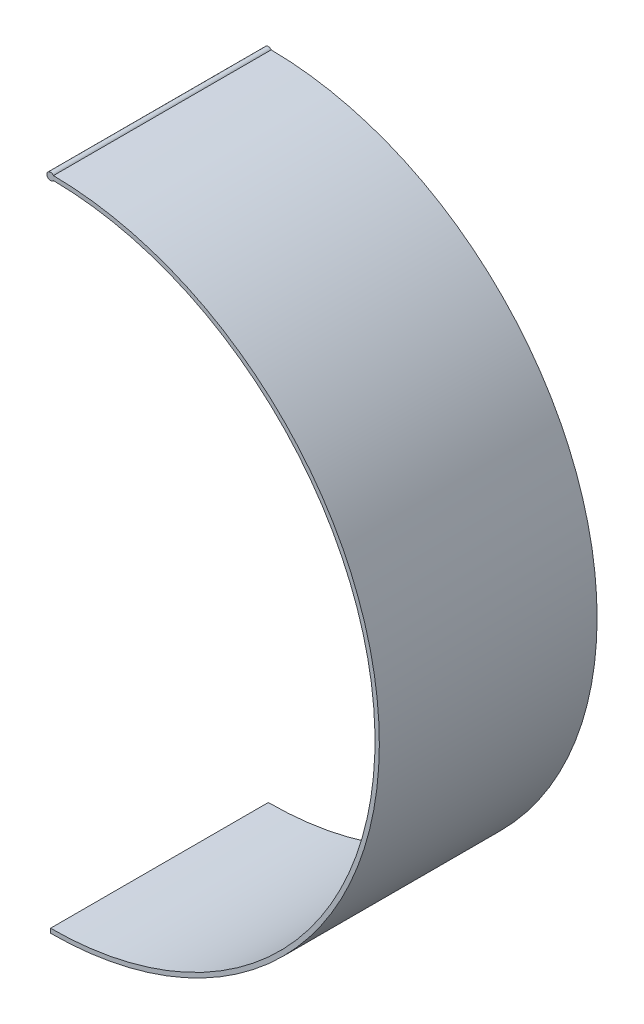
ISO-10303-21;
HEADER;
FILE_DESCRIPTION(('STEP AP214'),'2;1');
FILE_NAME('part.step','',(''),(''),'','','');
FILE_SCHEMA(('AUTOMOTIVE_DESIGN { 1 0 10303 214 1 1 1 1 }'));
ENDSEC;
DATA;
#1=APPLICATION_CONTEXT('core data for automotive mechanical design processes');
#2=APPLICATION_PROTOCOL_DEFINITION('international standard','automotive_design',2000,#1);
#3=PRODUCT_CONTEXT('',#1,'mechanical');
#4=PRODUCT('Part','Part','',(#3));
#5=PRODUCT_RELATED_PRODUCT_CATEGORY('part','',(#4));
#6=PRODUCT_DEFINITION_FORMATION('','',#4);
#7=PRODUCT_DEFINITION_CONTEXT('part definition',#1,'design');
#8=PRODUCT_DEFINITION('design','',#6,#7);
#9=PRODUCT_DEFINITION_SHAPE('','',#8);
#10=(LENGTH_UNIT() NAMED_UNIT(*) SI_UNIT(.MILLI.,.METRE.));
#11=(NAMED_UNIT(*) PLANE_ANGLE_UNIT() SI_UNIT($,.RADIAN.));
#12=(NAMED_UNIT(*) SI_UNIT($,.STERADIAN.) SOLID_ANGLE_UNIT());
#13=UNCERTAINTY_MEASURE_WITH_UNIT(LENGTH_MEASURE(1.E-05),#10,'distance_accuracy_value','');
#14=(GEOMETRIC_REPRESENTATION_CONTEXT(3) GLOBAL_UNCERTAINTY_ASSIGNED_CONTEXT((#13)) GLOBAL_UNIT_ASSIGNED_CONTEXT((#10,
#11,#12)) REPRESENTATION_CONTEXT('',''));
#15=CARTESIAN_POINT('',(0.,0.,0.));
#16=DIRECTION('',(0.,0.,1.));
#17=DIRECTION('',(1.,0.,0.));
#18=AXIS2_PLACEMENT_3D('',#15,#16,#17);
#19=CARTESIAN_POINT('',(0.,0.,15.));
#20=DIRECTION('',(0.,0.,-1.));
#21=DIRECTION('',(-1.,0.,0.));
#22=AXIS2_PLACEMENT_3D('',#19,#20,#21);
#23=CYLINDRICAL_SURFACE('',#22,0.25);
#24=CARTESIAN_POINT('',(0.,0.,15.));
#25=DIRECTION('',(0.,0.,1.));
#26=DIRECTION('',(1.,0.,0.));
#27=AXIS2_PLACEMENT_3D('',#24,#25,#26);
#28=CIRCLE('',#27,0.25);
#29=CARTESIAN_POINT('',(0.200663590477224,0.149111111111107,15.));
#30=VERTEX_POINT('',#29);
#31=CARTESIAN_POINT('',(0.199330236567053,-0.150888888888888,15.));
#32=VERTEX_POINT('',#31);
#33=EDGE_CURVE('E11',#30,#32,#28,.T.);
#34=ORIENTED_EDGE('',*,*,#33,.F.);
#35=DIRECTION('',(0.,0.,1.));
#36=VECTOR('',#35,1.);
#37=CARTESIAN_POINT('',(0.200663590477224,0.14911111111111,7.5));
#38=LINE('',#37,#36);
#39=CARTESIAN_POINT('',(0.200663590477224,0.14911111111111,0.));
#40=VERTEX_POINT('',#39);
#41=EDGE_CURVE('E106',#30,#40,#38,.F.);
#42=ORIENTED_EDGE('',*,*,#41,.T.);
#43=CARTESIAN_POINT('',(0.,0.,0.));
#44=DIRECTION('',(0.,0.,1.));
#45=DIRECTION('',(1.,0.,0.));
#46=AXIS2_PLACEMENT_3D('',#43,#44,#45);
#47=CIRCLE('',#46,0.25);
#48=CARTESIAN_POINT('',(0.199330236567053,-0.150888888888888,0.));
#49=VERTEX_POINT('',#48);
#50=EDGE_CURVE('E39',#40,#49,#47,.T.);
#51=ORIENTED_EDGE('',*,*,#50,.T.);
#52=DIRECTION('',(0.,0.,1.));
#53=VECTOR('',#52,1.);
#54=CARTESIAN_POINT('',(0.199330236567053,-0.150888888888888,7.5));
#55=LINE('',#54,#53);
#56=EDGE_CURVE('E83',#49,#32,#55,.T.);
#57=ORIENTED_EDGE('',*,*,#56,.T.);
#58=EDGE_LOOP('',(#34,#42,#51,#57));
#59=FACE_BOUND('',#58,.T.);
#60=ADVANCED_FACE('F36',(#59),#23,.T.);
#61=CARTESIAN_POINT('',(0.,0.,15.));
#62=DIRECTION('',(0.,0.,1.));
#63=DIRECTION('',(1.,0.,0.));
#64=AXIS2_PLACEMENT_3D('',#61,#62,#63);
#65=PLANE('',#64);
#66=ORIENTED_EDGE('',*,*,#33,.T.);
#67=CARTESIAN_POINT('',(0.,-22.5,15.));
#68=DIRECTION('',(0.,0.,-1.));
#69=DIRECTION('',(-1.,0.,0.));
#70=AXIS2_PLACEMENT_3D('',#67,#68,#69);
#71=CIRCLE('',#70,22.35);
#72=CARTESIAN_POINT('',(0.,-44.85,15.));
#73=VERTEX_POINT('',#72);
#74=EDGE_CURVE('E101',#32,#73,#71,.T.);
#75=ORIENTED_EDGE('',*,*,#74,.T.);
#76=DIRECTION('',(0.,-1.,0.));
#77=VECTOR('',#76,1.);
#78=CARTESIAN_POINT('',(0.,-44.85,15.));
#79=LINE('',#78,#77);
#80=CARTESIAN_POINT('',(0.,-45.15,15.));
#81=VERTEX_POINT('',#80);
#82=EDGE_CURVE('E93',#73,#81,#79,.T.);
#83=ORIENTED_EDGE('',*,*,#82,.T.);
#84=CARTESIAN_POINT('',(0.,-22.5,15.));
#85=DIRECTION('',(0.,0.,1.));
#86=DIRECTION('',(-1.,0.,0.));
#87=AXIS2_PLACEMENT_3D('',#84,#85,#86);
#88=CIRCLE('',#87,22.65);
#89=EDGE_CURVE('E49',#81,#30,#88,.T.);
#90=ORIENTED_EDGE('',*,*,#89,.T.);
#91=EDGE_LOOP('',(#66,#75,#83,#90));
#92=FACE_BOUND('',#91,.T.);
#93=ADVANCED_FACE('F109',(#92),#65,.T.);
#94=CARTESIAN_POINT('',(0.,0.,0.));
#95=DIRECTION('',(0.,0.,1.));
#96=DIRECTION('',(1.,0.,0.));
#97=AXIS2_PLACEMENT_3D('',#94,#95,#96);
#98=PLANE('',#97);
#99=ORIENTED_EDGE('',*,*,#50,.F.);
#100=CARTESIAN_POINT('',(0.,-22.5,0.));
#101=DIRECTION('',(0.,0.,1.));
#102=DIRECTION('',(-1.,0.,0.));
#103=AXIS2_PLACEMENT_3D('',#100,#101,#102);
#104=CIRCLE('',#103,22.65);
#105=CARTESIAN_POINT('',(0.,-45.15,0.));
#106=VERTEX_POINT('',#105);
#107=EDGE_CURVE('E56',#106,#40,#104,.T.);
#108=ORIENTED_EDGE('',*,*,#107,.F.);
#109=DIRECTION('',(0.,-1.,0.));
#110=VECTOR('',#109,1.);
#111=CARTESIAN_POINT('',(0.,-44.85,0.));
#112=LINE('',#111,#110);
#113=CARTESIAN_POINT('',(0.,-44.85,0.));
#114=VERTEX_POINT('',#113);
#115=EDGE_CURVE('E88',#114,#106,#112,.T.);
#116=ORIENTED_EDGE('',*,*,#115,.F.);
#117=CARTESIAN_POINT('',(0.,-22.5,0.));
#118=DIRECTION('',(0.,0.,-1.));
#119=DIRECTION('',(-1.,0.,0.));
#120=AXIS2_PLACEMENT_3D('',#117,#118,#119);
#121=CIRCLE('',#120,22.35);
#122=EDGE_CURVE('E77',#49,#114,#121,.T.);
#123=ORIENTED_EDGE('',*,*,#122,.F.);
#124=EDGE_LOOP('',(#99,#108,#116,#123));
#125=FACE_BOUND('',#124,.T.);
#126=ADVANCED_FACE('F96',(#125),#98,.F.);
#127=CARTESIAN_POINT('',(0.,-22.5,0.));
#128=DIRECTION('',(0.,0.,1.));
#129=DIRECTION('',(1.,0.,0.));
#130=AXIS2_PLACEMENT_3D('',#127,#128,#129);
#131=CYLINDRICAL_SURFACE('',#130,22.65);
#132=ORIENTED_EDGE('',*,*,#41,.F.);
#133=ORIENTED_EDGE('',*,*,#89,.F.);
#134=DIRECTION('',(0.,0.,1.));
#135=VECTOR('',#134,1.);
#136=CARTESIAN_POINT('',(0.,-45.15,0.));
#137=LINE('',#136,#135);
#138=EDGE_CURVE('E94',#106,#81,#137,.T.);
#139=ORIENTED_EDGE('',*,*,#138,.F.);
#140=ORIENTED_EDGE('',*,*,#107,.T.);
#141=EDGE_LOOP('',(#132,#133,#139,#140));
#142=FACE_BOUND('',#141,.T.);
#143=ADVANCED_FACE('F116',(#142),#131,.T.);
#144=CARTESIAN_POINT('',(0.,-22.5,0.));
#145=DIRECTION('',(0.,0.,1.));
#146=DIRECTION('',(1.,0.,0.));
#147=AXIS2_PLACEMENT_3D('',#144,#145,#146);
#148=CYLINDRICAL_SURFACE('',#147,22.35);
#149=ORIENTED_EDGE('',*,*,#56,.F.);
#150=ORIENTED_EDGE('',*,*,#122,.T.);
#151=DIRECTION('',(0.,0.,1.));
#152=VECTOR('',#151,1.);
#153=CARTESIAN_POINT('',(0.,-44.85,0.));
#154=LINE('',#153,#152);
#155=EDGE_CURVE('E80',#114,#73,#154,.T.);
#156=ORIENTED_EDGE('',*,*,#155,.T.);
#157=ORIENTED_EDGE('',*,*,#74,.F.);
#158=EDGE_LOOP('',(#149,#150,#156,#157));
#159=FACE_BOUND('',#158,.T.);
#160=ADVANCED_FACE('F79',(#159),#148,.F.);
#161=CARTESIAN_POINT('',(0.,-44.85,0.));
#162=DIRECTION('',(-1.,0.,0.));
#163=DIRECTION('',(0.,-1.,0.));
#164=AXIS2_PLACEMENT_3D('',#161,#162,#163);
#165=PLANE('',#164);
#166=ORIENTED_EDGE('',*,*,#82,.F.);
#167=ORIENTED_EDGE('',*,*,#155,.F.);
#168=ORIENTED_EDGE('',*,*,#115,.T.);
#169=ORIENTED_EDGE('',*,*,#138,.T.);
#170=EDGE_LOOP('',(#166,#167,#168,#169));
#171=FACE_BOUND('',#170,.T.);
#172=ADVANCED_FACE('F92',(#171),#165,.T.);
#173=CLOSED_SHELL('',(#60,#93,#126,#143,#160,#172));
#174=MANIFOLD_SOLID_BREP('B2',#173);
#175=ADVANCED_BREP_SHAPE_REPRESENTATION('',(#18,#174),#14);
#176=SHAPE_DEFINITION_REPRESENTATION(#9,#175);
ENDSEC;
END-ISO-10303-21;
